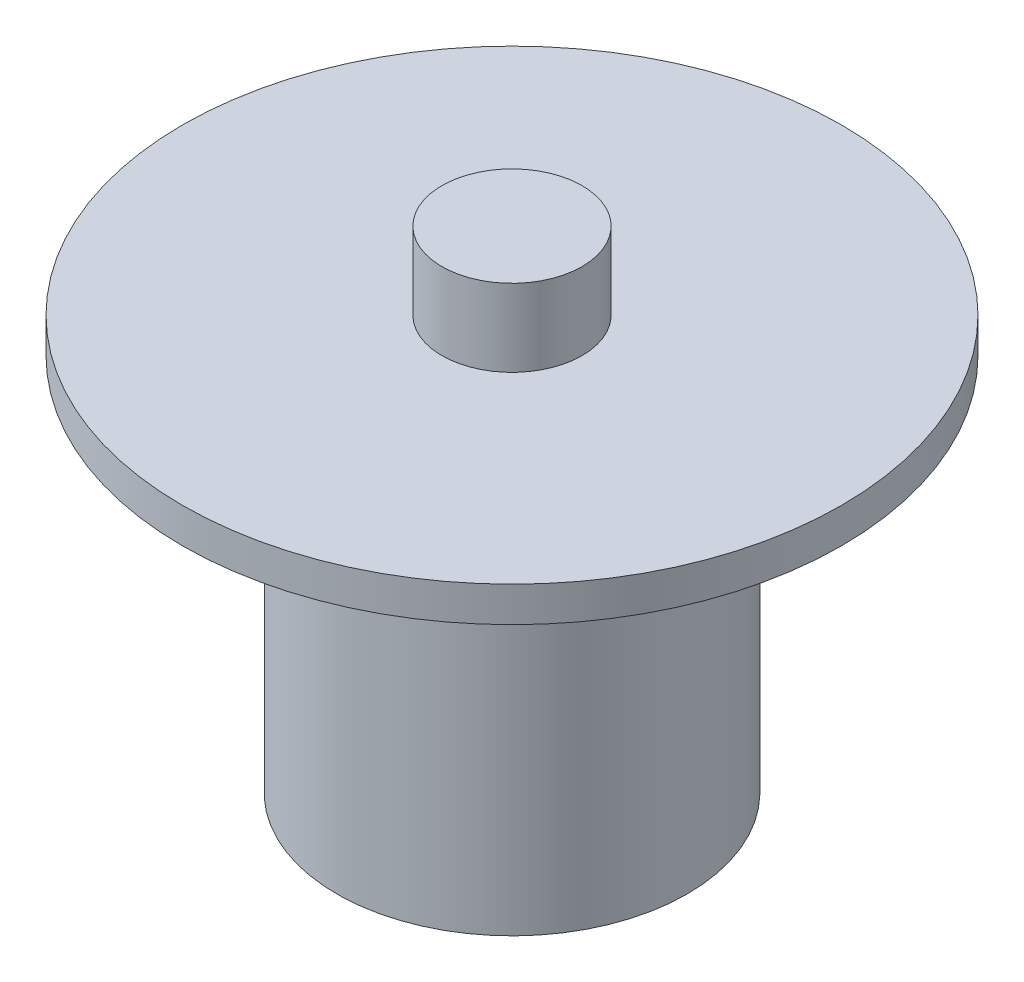
ISO-10303-21;
HEADER;
FILE_DESCRIPTION(('STEP AP214'),'2;1');
FILE_NAME('part.step','',(''),(''),'','','');
FILE_SCHEMA(('AUTOMOTIVE_DESIGN { 1 0 10303 214 1 1 1 1 }'));
ENDSEC;
DATA;
#1=APPLICATION_CONTEXT('core data for automotive mechanical design processes');
#2=APPLICATION_PROTOCOL_DEFINITION('international standard','automotive_design',2000,#1);
#3=PRODUCT_CONTEXT('',#1,'mechanical');
#4=PRODUCT('Part','Part','',(#3));
#5=PRODUCT_RELATED_PRODUCT_CATEGORY('part','',(#4));
#6=PRODUCT_DEFINITION_FORMATION('','',#4);
#7=PRODUCT_DEFINITION_CONTEXT('part definition',#1,'design');
#8=PRODUCT_DEFINITION('design','',#6,#7);
#9=PRODUCT_DEFINITION_SHAPE('','',#8);
#10=(LENGTH_UNIT() NAMED_UNIT(*) SI_UNIT(.MILLI.,.METRE.));
#11=(NAMED_UNIT(*) PLANE_ANGLE_UNIT() SI_UNIT($,.RADIAN.));
#12=(NAMED_UNIT(*) SI_UNIT($,.STERADIAN.) SOLID_ANGLE_UNIT());
#13=UNCERTAINTY_MEASURE_WITH_UNIT(LENGTH_MEASURE(1.E-05),#10,'distance_accuracy_value','');
#14=(GEOMETRIC_REPRESENTATION_CONTEXT(3) GLOBAL_UNCERTAINTY_ASSIGNED_CONTEXT((#13)) GLOBAL_UNIT_ASSIGNED_CONTEXT((#10,
#11,#12)) REPRESENTATION_CONTEXT('',''));
#15=CARTESIAN_POINT('',(0.,0.,0.));
#16=DIRECTION('',(0.,0.,1.));
#17=DIRECTION('',(1.,0.,0.));
#18=AXIS2_PLACEMENT_3D('',#15,#16,#17);
#19=CARTESIAN_POINT('',(0.,8.75,0.));
#20=DIRECTION('',(0.,-1.,0.));
#21=DIRECTION('',(1.,0.,0.));
#22=AXIS2_PLACEMENT_3D('',#19,#20,#21);
#23=PLANE('',#22);
#24=CARTESIAN_POINT('',(0.,8.75,0.));
#25=DIRECTION('',(0.,-1.,0.));
#26=DIRECTION('',(1.,0.,0.));
#27=AXIS2_PLACEMENT_3D('',#24,#25,#26);
#28=CIRCLE('',#27,2.5);
#29=CARTESIAN_POINT('',(2.5,8.75,0.));
#30=VERTEX_POINT('',#29);
#31=EDGE_CURVE('E10',#30,#30,#28,.T.);
#32=ORIENTED_EDGE('',*,*,#31,.F.);
#33=EDGE_LOOP('',(#32));
#34=FACE_BOUND('',#33,.T.);
#35=ADVANCED_FACE('F30',(#34),#23,.F.);
#36=CARTESIAN_POINT('',(0.,-8.75,0.));
#37=DIRECTION('',(0.,-1.,0.));
#38=DIRECTION('',(1.,0.,0.));
#39=AXIS2_PLACEMENT_3D('',#36,#37,#38);
#40=CYLINDRICAL_SURFACE('',#39,2.5);
#41=CARTESIAN_POINT('',(0.,6.,0.));
#42=DIRECTION('',(0.,-1.,0.));
#43=DIRECTION('',(1.,0.,0.));
#44=AXIS2_PLACEMENT_3D('',#41,#42,#43);
#45=CIRCLE('',#44,2.5);
#46=CARTESIAN_POINT('',(2.5,6.,0.));
#47=VERTEX_POINT('',#46);
#48=EDGE_CURVE('E36',#47,#47,#45,.T.);
#49=ORIENTED_EDGE('',*,*,#48,.F.);
#50=EDGE_LOOP('',(#49));
#51=FACE_BOUND('',#50,.T.);
#52=ORIENTED_EDGE('',*,*,#31,.T.);
#53=EDGE_LOOP('',(#52));
#54=FACE_BOUND('',#53,.T.);
#55=ADVANCED_FACE('F78',(#51,#54),#40,.T.);
#56=CARTESIAN_POINT('',(-2.5,6.,0.));
#57=DIRECTION('',(0.,-1.,0.));
#58=DIRECTION('',(1.,0.,0.));
#59=AXIS2_PLACEMENT_3D('',#56,#57,#58);
#60=PLANE('',#59);
#61=CARTESIAN_POINT('',(0.,6.,0.));
#62=DIRECTION('',(0.,-1.,0.));
#63=DIRECTION('',(1.,0.,0.));
#64=AXIS2_PLACEMENT_3D('',#61,#62,#63);
#65=CIRCLE('',#64,11.75);
#66=CARTESIAN_POINT('',(11.75,6.,0.));
#67=VERTEX_POINT('',#66);
#68=EDGE_CURVE('E40',#67,#67,#65,.T.);
#69=ORIENTED_EDGE('',*,*,#68,.F.);
#70=EDGE_LOOP('',(#69));
#71=FACE_BOUND('',#70,.T.);
#72=ORIENTED_EDGE('',*,*,#48,.T.);
#73=EDGE_LOOP('',(#72));
#74=FACE_BOUND('',#73,.T.);
#75=ADVANCED_FACE('F73',(#71,#74),#60,.F.);
#76=CARTESIAN_POINT('',(0.,-8.75,0.));
#77=DIRECTION('',(0.,-1.,0.));
#78=DIRECTION('',(1.,0.,0.));
#79=AXIS2_PLACEMENT_3D('',#76,#77,#78);
#80=CYLINDRICAL_SURFACE('',#79,11.75);
#81=CARTESIAN_POINT('',(0.,4.75,0.));
#82=DIRECTION('',(0.,-1.,0.));
#83=DIRECTION('',(1.,0.,0.));
#84=AXIS2_PLACEMENT_3D('',#81,#82,#83);
#85=CIRCLE('',#84,11.75);
#86=CARTESIAN_POINT('',(11.75,4.75,0.));
#87=VERTEX_POINT('',#86);
#88=EDGE_CURVE('E44',#87,#87,#85,.T.);
#89=ORIENTED_EDGE('',*,*,#88,.F.);
#90=EDGE_LOOP('',(#89));
#91=FACE_BOUND('',#90,.T.);
#92=ORIENTED_EDGE('',*,*,#68,.T.);
#93=EDGE_LOOP('',(#92));
#94=FACE_BOUND('',#93,.T.);
#95=ADVANCED_FACE('F67',(#91,#94),#80,.T.);
#96=CARTESIAN_POINT('',(-11.75,4.75,0.));
#97=DIRECTION('',(0.,1.,0.));
#98=DIRECTION('',(-1.,0.,0.));
#99=AXIS2_PLACEMENT_3D('',#96,#97,#98);
#100=PLANE('',#99);
#101=CARTESIAN_POINT('',(0.,4.75,0.));
#102=DIRECTION('',(0.,-1.,0.));
#103=DIRECTION('',(1.,0.,0.));
#104=AXIS2_PLACEMENT_3D('',#101,#102,#103);
#105=CIRCLE('',#104,6.25);
#106=CARTESIAN_POINT('',(6.25,4.75,0.));
#107=VERTEX_POINT('',#106);
#108=EDGE_CURVE('E49',#107,#107,#105,.T.);
#109=ORIENTED_EDGE('',*,*,#108,.F.);
#110=EDGE_LOOP('',(#109));
#111=FACE_BOUND('',#110,.T.);
#112=ORIENTED_EDGE('',*,*,#88,.T.);
#113=EDGE_LOOP('',(#112));
#114=FACE_BOUND('',#113,.T.);
#115=ADVANCED_FACE('F61',(#111,#114),#100,.F.);
#116=CARTESIAN_POINT('',(0.,-8.75,0.));
#117=DIRECTION('',(0.,-1.,0.));
#118=DIRECTION('',(1.,0.,0.));
#119=AXIS2_PLACEMENT_3D('',#116,#117,#118);
#120=CYLINDRICAL_SURFACE('',#119,6.25);
#121=CARTESIAN_POINT('',(0.,-8.75,0.));
#122=DIRECTION('',(0.,-1.,0.));
#123=DIRECTION('',(1.,0.,0.));
#124=AXIS2_PLACEMENT_3D('',#121,#122,#123);
#125=CIRCLE('',#124,6.25);
#126=CARTESIAN_POINT('',(6.25,-8.75,0.));
#127=VERTEX_POINT('',#126);
#128=EDGE_CURVE('E52',#127,#127,#125,.T.);
#129=ORIENTED_EDGE('',*,*,#128,.F.);
#130=EDGE_LOOP('',(#129));
#131=FACE_BOUND('',#130,.T.);
#132=ORIENTED_EDGE('',*,*,#108,.T.);
#133=EDGE_LOOP('',(#132));
#134=FACE_BOUND('',#133,.T.);
#135=ADVANCED_FACE('F58',(#131,#134),#120,.T.);
#136=CARTESIAN_POINT('',(-6.25,-8.75,0.));
#137=DIRECTION('',(0.,1.,0.));
#138=DIRECTION('',(-1.,0.,0.));
#139=AXIS2_PLACEMENT_3D('',#136,#137,#138);
#140=PLANE('',#139);
#141=ORIENTED_EDGE('',*,*,#128,.T.);
#142=EDGE_LOOP('',(#141));
#143=FACE_BOUND('',#142,.T.);
#144=ADVANCED_FACE('F56',(#143),#140,.F.);
#145=CLOSED_SHELL('',(#35,#55,#75,#95,#115,#135,#144));
#146=MANIFOLD_SOLID_BREP('B2',#145);
#147=ADVANCED_BREP_SHAPE_REPRESENTATION('',(#18,#146),#14);
#148=SHAPE_DEFINITION_REPRESENTATION(#9,#147);
ENDSEC;
END-ISO-10303-21;
